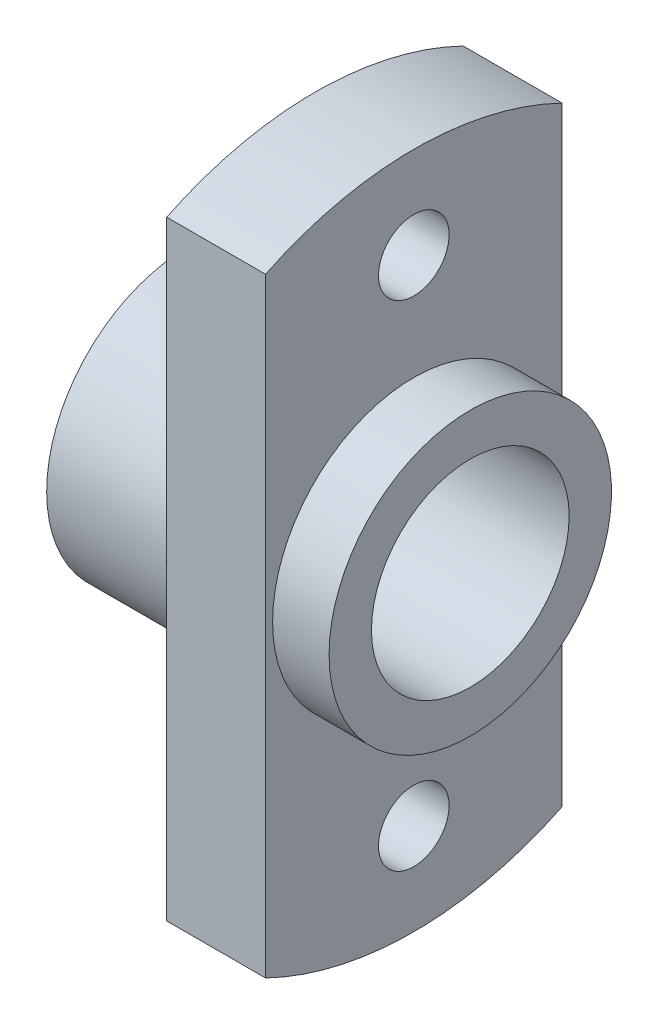
ISO-10303-21;
HEADER;
FILE_DESCRIPTION(('STEP AP214'),'2;1');
FILE_NAME('part.step','',(''),(''),'','','');
FILE_SCHEMA(('AUTOMOTIVE_DESIGN { 1 0 10303 214 1 1 1 1 }'));
ENDSEC;
DATA;
#1=APPLICATION_CONTEXT('core data for automotive mechanical design processes');
#2=APPLICATION_PROTOCOL_DEFINITION('international standard','automotive_design',2000,#1);
#3=PRODUCT_CONTEXT('',#1,'mechanical');
#4=PRODUCT('Part','Part','',(#3));
#5=PRODUCT_RELATED_PRODUCT_CATEGORY('part','',(#4));
#6=PRODUCT_DEFINITION_FORMATION('','',#4);
#7=PRODUCT_DEFINITION_CONTEXT('part definition',#1,'design');
#8=PRODUCT_DEFINITION('design','',#6,#7);
#9=PRODUCT_DEFINITION_SHAPE('','',#8);
#10=(LENGTH_UNIT() NAMED_UNIT(*) SI_UNIT(.MILLI.,.METRE.));
#11=(NAMED_UNIT(*) PLANE_ANGLE_UNIT() SI_UNIT($,.RADIAN.));
#12=(NAMED_UNIT(*) SI_UNIT($,.STERADIAN.) SOLID_ANGLE_UNIT());
#13=UNCERTAINTY_MEASURE_WITH_UNIT(LENGTH_MEASURE(1.E-05),#10,'distance_accuracy_value','');
#14=(GEOMETRIC_REPRESENTATION_CONTEXT(3) GLOBAL_UNCERTAINTY_ASSIGNED_CONTEXT((#13)) GLOBAL_UNIT_ASSIGNED_CONTEXT((#10,
#11,#12)) REPRESENTATION_CONTEXT('',''));
#15=CARTESIAN_POINT('',(0.,0.,0.));
#16=DIRECTION('',(0.,0.,1.));
#17=DIRECTION('',(1.,0.,0.));
#18=AXIS2_PLACEMENT_3D('',#15,#16,#17);
#19=CARTESIAN_POINT('',(-27.2262395336304,0.,0.));
#20=DIRECTION('',(-1.,0.,0.));
#21=DIRECTION('',(0.,0.,1.));
#22=AXIS2_PLACEMENT_3D('',#19,#20,#21);
#23=CYLINDRICAL_SURFACE('',#22,12.);
#24=CARTESIAN_POINT('',(8.,0.,0.));
#25=DIRECTION('',(-1.,0.,0.));
#26=DIRECTION('',(0.,0.,1.));
#27=AXIS2_PLACEMENT_3D('',#24,#25,#26);
#28=CIRCLE('',#27,12.);
#29=CARTESIAN_POINT('',(8.,10.7906209274536,5.25));
#30=VERTEX_POINT('',#29);
#31=CARTESIAN_POINT('',(8.,10.7906209274536,-5.25));
#32=VERTEX_POINT('',#31);
#33=EDGE_CURVE('E87',#30,#32,#28,.T.);
#34=ORIENTED_EDGE('',*,*,#33,.T.);
#35=DIRECTION('',(-1.,0.,0.));
#36=VECTOR('',#35,1.);
#37=CARTESIAN_POINT('',(-27.2262395336304,10.7906209274536,-5.25));
#38=LINE('',#37,#36);
#39=CARTESIAN_POINT('',(4.5,10.7906209274536,-5.25));
#40=VERTEX_POINT('',#39);
#41=EDGE_CURVE('E61',#32,#40,#38,.T.);
#42=ORIENTED_EDGE('',*,*,#41,.T.);
#43=CARTESIAN_POINT('',(4.5,0.,0.));
#44=DIRECTION('',(-1.,0.,0.));
#45=DIRECTION('',(0.,0.,1.));
#46=AXIS2_PLACEMENT_3D('',#43,#44,#45);
#47=CIRCLE('',#46,12.);
#48=CARTESIAN_POINT('',(4.5,10.7906209274536,5.25));
#49=VERTEX_POINT('',#48);
#50=EDGE_CURVE('E89',#49,#40,#47,.T.);
#51=ORIENTED_EDGE('',*,*,#50,.F.);
#52=DIRECTION('',(-1.,0.,0.));
#53=VECTOR('',#52,1.);
#54=CARTESIAN_POINT('',(-27.2262395336304,10.7906209274536,5.25));
#55=LINE('',#54,#53);
#56=EDGE_CURVE('E77',#49,#30,#55,.F.);
#57=ORIENTED_EDGE('',*,*,#56,.T.);
#58=EDGE_LOOP('',(#34,#42,#51,#57));
#59=FACE_BOUND('',#58,.T.);
#60=ADVANCED_FACE('F38',(#59),#23,.T.);
#61=CARTESIAN_POINT('',(0.,0.,0.));
#62=DIRECTION('',(1.,0.,0.));
#63=DIRECTION('',(0.,0.,-1.));
#64=AXIS2_PLACEMENT_3D('',#61,#62,#63);
#65=PLANE('',#64);
#66=CARTESIAN_POINT('',(0.,0.,0.));
#67=DIRECTION('',(1.,0.,0.));
#68=DIRECTION('',(0.,0.,-1.));
#69=AXIS2_PLACEMENT_3D('',#66,#67,#68);
#70=CIRCLE('',#69,3.5);
#71=CARTESIAN_POINT('',(0.,0.,-3.5));
#72=VERTEX_POINT('',#71);
#73=EDGE_CURVE('E143',#72,#72,#70,.T.);
#74=ORIENTED_EDGE('',*,*,#73,.T.);
#75=EDGE_LOOP('',(#74));
#76=FACE_BOUND('',#75,.T.);
#77=CARTESIAN_POINT('',(0.,0.,0.));
#78=DIRECTION('',(-1.,0.,0.));
#79=DIRECTION('',(0.,0.,1.));
#80=AXIS2_PLACEMENT_3D('',#77,#78,#79);
#81=CIRCLE('',#80,5.);
#82=CARTESIAN_POINT('',(0.,0.,5.));
#83=VERTEX_POINT('',#82);
#84=EDGE_CURVE('E83',#83,#83,#81,.T.);
#85=ORIENTED_EDGE('',*,*,#84,.T.);
#86=EDGE_LOOP('',(#85));
#87=FACE_BOUND('',#86,.T.);
#88=ADVANCED_FACE('F40',(#76,#87),#65,.F.);
#89=CARTESIAN_POINT('',(-27.2262395336304,0.,0.));
#90=DIRECTION('',(-1.,0.,0.));
#91=DIRECTION('',(0.,0.,1.));
#92=AXIS2_PLACEMENT_3D('',#89,#90,#91);
#93=CYLINDRICAL_SURFACE('',#92,5.);
#94=ORIENTED_EDGE('',*,*,#84,.F.);
#95=EDGE_LOOP('',(#94));
#96=FACE_BOUND('',#95,.T.);
#97=CARTESIAN_POINT('',(4.5,0.,0.));
#98=DIRECTION('',(-1.,0.,0.));
#99=DIRECTION('',(0.,0.,1.));
#100=AXIS2_PLACEMENT_3D('',#97,#98,#99);
#101=CIRCLE('',#100,5.);
#102=CARTESIAN_POINT('',(4.5,0.,5.));
#103=VERTEX_POINT('',#102);
#104=EDGE_CURVE('E104',#103,#103,#101,.T.);
#105=ORIENTED_EDGE('',*,*,#104,.T.);
#106=EDGE_LOOP('',(#105));
#107=FACE_BOUND('',#106,.T.);
#108=ADVANCED_FACE('F111',(#96,#107),#93,.T.);
#109=CARTESIAN_POINT('',(4.5,5.,0.));
#110=DIRECTION('',(1.,0.,0.));
#111=DIRECTION('',(0.,0.,-1.));
#112=AXIS2_PLACEMENT_3D('',#109,#110,#111);
#113=PLANE('',#112);
#114=CARTESIAN_POINT('',(4.5,-8.75,0.));
#115=DIRECTION('',(1.,0.,0.));
#116=DIRECTION('',(0.,0.,-1.));
#117=AXIS2_PLACEMENT_3D('',#114,#115,#116);
#118=CIRCLE('',#117,1.25);
#119=CARTESIAN_POINT('',(4.5,-8.75,-1.25));
#120=VERTEX_POINT('',#119);
#121=EDGE_CURVE('E132',#120,#120,#118,.T.);
#122=ORIENTED_EDGE('',*,*,#121,.T.);
#123=EDGE_LOOP('',(#122));
#124=FACE_BOUND('',#123,.T.);
#125=CARTESIAN_POINT('',(4.5,8.75,0.));
#126=DIRECTION('',(1.,0.,0.));
#127=DIRECTION('',(0.,0.,-1.));
#128=AXIS2_PLACEMENT_3D('',#125,#126,#127);
#129=CIRCLE('',#128,1.25);
#130=CARTESIAN_POINT('',(4.5,8.75,-1.25));
#131=VERTEX_POINT('',#130);
#132=EDGE_CURVE('E126',#131,#131,#129,.T.);
#133=ORIENTED_EDGE('',*,*,#132,.T.);
#134=EDGE_LOOP('',(#133));
#135=FACE_BOUND('',#134,.T.);
#136=ORIENTED_EDGE('',*,*,#104,.F.);
#137=EDGE_LOOP('',(#136));
#138=FACE_BOUND('',#137,.T.);
#139=ORIENTED_EDGE('',*,*,#50,.T.);
#140=DIRECTION('',(0.,-1.,0.));
#141=VECTOR('',#140,1.);
#142=CARTESIAN_POINT('',(4.5,5.,-5.25));
#143=LINE('',#142,#141);
#144=CARTESIAN_POINT('',(4.5,-10.7906209274536,-5.25));
#145=VERTEX_POINT('',#144);
#146=EDGE_CURVE('E123',#40,#145,#143,.T.);
#147=ORIENTED_EDGE('',*,*,#146,.T.);
#148=CARTESIAN_POINT('',(4.5,-10.7906209274536,5.25));
#149=VERTEX_POINT('',#148);
#150=EDGE_CURVE('E95',#145,#149,#47,.T.);
#151=ORIENTED_EDGE('',*,*,#150,.T.);
#152=DIRECTION('',(0.,1.,0.));
#153=VECTOR('',#152,1.);
#154=CARTESIAN_POINT('',(4.5,5.,5.25));
#155=LINE('',#154,#153);
#156=EDGE_CURVE('E90',#149,#49,#155,.T.);
#157=ORIENTED_EDGE('',*,*,#156,.T.);
#158=EDGE_LOOP('',(#139,#147,#151,#157));
#159=FACE_BOUND('',#158,.T.);
#160=ADVANCED_FACE('F114',(#124,#135,#138,#159),#113,.F.);
#161=ORIENTED_EDGE('',*,*,#150,.F.);
#162=DIRECTION('',(-1.,0.,0.));
#163=VECTOR('',#162,1.);
#164=CARTESIAN_POINT('',(-27.2262395336304,-10.7906209274536,-5.25));
#165=LINE('',#164,#163);
#166=CARTESIAN_POINT('',(8.,-10.7906209274536,-5.25));
#167=VERTEX_POINT('',#166);
#168=EDGE_CURVE('E135',#145,#167,#165,.F.);
#169=ORIENTED_EDGE('',*,*,#168,.T.);
#170=CARTESIAN_POINT('',(8.,-10.7906209274536,5.25));
#171=VERTEX_POINT('',#170);
#172=EDGE_CURVE('E96',#167,#171,#28,.T.);
#173=ORIENTED_EDGE('',*,*,#172,.T.);
#174=DIRECTION('',(-1.,0.,0.));
#175=VECTOR('',#174,1.);
#176=CARTESIAN_POINT('',(-27.2262395336304,-10.7906209274536,5.25));
#177=LINE('',#176,#175);
#178=EDGE_CURVE('E53',#171,#149,#177,.T.);
#179=ORIENTED_EDGE('',*,*,#178,.T.);
#180=EDGE_LOOP('',(#161,#169,#173,#179));
#181=FACE_BOUND('',#180,.T.);
#182=ADVANCED_FACE('F119',(#181),#23,.T.);
#183=CARTESIAN_POINT('',(8.,12.,0.));
#184=DIRECTION('',(-1.,0.,0.));
#185=DIRECTION('',(0.,0.,1.));
#186=AXIS2_PLACEMENT_3D('',#183,#184,#185);
#187=PLANE('',#186);
#188=CARTESIAN_POINT('',(8.,-8.75,0.));
#189=DIRECTION('',(1.,0.,0.));
#190=DIRECTION('',(0.,0.,-1.));
#191=AXIS2_PLACEMENT_3D('',#188,#189,#190);
#192=CIRCLE('',#191,1.25);
#193=CARTESIAN_POINT('',(8.,-8.75,-1.25));
#194=VERTEX_POINT('',#193);
#195=EDGE_CURVE('E281',#194,#194,#192,.T.);
#196=ORIENTED_EDGE('',*,*,#195,.F.);
#197=EDGE_LOOP('',(#196));
#198=FACE_BOUND('',#197,.T.);
#199=CARTESIAN_POINT('',(8.,8.75,0.));
#200=DIRECTION('',(1.,0.,0.));
#201=DIRECTION('',(0.,0.,-1.));
#202=AXIS2_PLACEMENT_3D('',#199,#200,#201);
#203=CIRCLE('',#202,1.25);
#204=CARTESIAN_POINT('',(8.,8.75,-1.25));
#205=VERTEX_POINT('',#204);
#206=EDGE_CURVE('E91',#205,#205,#203,.T.);
#207=ORIENTED_EDGE('',*,*,#206,.F.);
#208=EDGE_LOOP('',(#207));
#209=FACE_BOUND('',#208,.T.);
#210=ORIENTED_EDGE('',*,*,#172,.F.);
#211=DIRECTION('',(0.,1.,0.));
#212=VECTOR('',#211,1.);
#213=CARTESIAN_POINT('',(8.,12.,-5.25));
#214=LINE('',#213,#212);
#215=EDGE_CURVE('E11',#167,#32,#214,.T.);
#216=ORIENTED_EDGE('',*,*,#215,.T.);
#217=ORIENTED_EDGE('',*,*,#33,.F.);
#218=DIRECTION('',(0.,-1.,0.));
#219=VECTOR('',#218,1.);
#220=CARTESIAN_POINT('',(8.,12.,5.25));
#221=LINE('',#220,#219);
#222=EDGE_CURVE('E46',#30,#171,#221,.T.);
#223=ORIENTED_EDGE('',*,*,#222,.T.);
#224=EDGE_LOOP('',(#210,#216,#217,#223));
#225=FACE_BOUND('',#224,.T.);
#226=CARTESIAN_POINT('',(8.,0.,0.));
#227=DIRECTION('',(-1.,0.,0.));
#228=DIRECTION('',(0.,0.,1.));
#229=AXIS2_PLACEMENT_3D('',#226,#227,#228);
#230=CIRCLE('',#229,5.);
#231=CARTESIAN_POINT('',(8.,0.,5.));
#232=VERTEX_POINT('',#231);
#233=EDGE_CURVE('E100',#232,#232,#230,.T.);
#234=ORIENTED_EDGE('',*,*,#233,.T.);
#235=EDGE_LOOP('',(#234));
#236=FACE_BOUND('',#235,.T.);
#237=ADVANCED_FACE('F93',(#198,#209,#225,#236),#187,.F.);
#238=CARTESIAN_POINT('',(-27.2262395336304,0.,0.));
#239=DIRECTION('',(-1.,0.,0.));
#240=DIRECTION('',(0.,0.,1.));
#241=AXIS2_PLACEMENT_3D('',#238,#239,#240);
#242=CYLINDRICAL_SURFACE('',#241,5.);
#243=ORIENTED_EDGE('',*,*,#233,.F.);
#244=EDGE_LOOP('',(#243));
#245=FACE_BOUND('',#244,.T.);
#246=CARTESIAN_POINT('',(10.,0.,0.));
#247=DIRECTION('',(-1.,0.,0.));
#248=DIRECTION('',(0.,0.,1.));
#249=AXIS2_PLACEMENT_3D('',#246,#247,#248);
#250=CIRCLE('',#249,5.);
#251=CARTESIAN_POINT('',(10.,0.,5.));
#252=VERTEX_POINT('',#251);
#253=EDGE_CURVE('E145',#252,#252,#250,.T.);
#254=ORIENTED_EDGE('',*,*,#253,.T.);
#255=EDGE_LOOP('',(#254));
#256=FACE_BOUND('',#255,.T.);
#257=ADVANCED_FACE('F152',(#245,#256),#242,.T.);
#258=CARTESIAN_POINT('',(10.,5.,0.));
#259=DIRECTION('',(-1.,0.,0.));
#260=DIRECTION('',(0.,0.,1.));
#261=AXIS2_PLACEMENT_3D('',#258,#259,#260);
#262=PLANE('',#261);
#263=CARTESIAN_POINT('',(10.,0.,0.));
#264=DIRECTION('',(1.,0.,0.));
#265=DIRECTION('',(0.,0.,-1.));
#266=AXIS2_PLACEMENT_3D('',#263,#264,#265);
#267=CIRCLE('',#266,3.5);
#268=CARTESIAN_POINT('',(10.,0.,-3.5));
#269=VERTEX_POINT('',#268);
#270=EDGE_CURVE('E140',#269,#269,#267,.T.);
#271=ORIENTED_EDGE('',*,*,#270,.F.);
#272=EDGE_LOOP('',(#271));
#273=FACE_BOUND('',#272,.T.);
#274=ORIENTED_EDGE('',*,*,#253,.F.);
#275=EDGE_LOOP('',(#274));
#276=FACE_BOUND('',#275,.T.);
#277=ADVANCED_FACE('F154',(#273,#276),#262,.F.);
#278=CARTESIAN_POINT('',(10.,0.,0.));
#279=DIRECTION('',(1.,0.,0.));
#280=DIRECTION('',(0.,0.,-1.));
#281=AXIS2_PLACEMENT_3D('',#278,#279,#280);
#282=CYLINDRICAL_SURFACE('',#281,3.5);
#283=ORIENTED_EDGE('',*,*,#73,.F.);
#284=EDGE_LOOP('',(#283));
#285=FACE_BOUND('',#284,.T.);
#286=ORIENTED_EDGE('',*,*,#270,.T.);
#287=EDGE_LOOP('',(#286));
#288=FACE_BOUND('',#287,.T.);
#289=ADVANCED_FACE('F160',(#285,#288),#282,.F.);
#290=CARTESIAN_POINT('',(0.,14.9424549187947,5.25));
#291=DIRECTION('',(0.,0.,-1.));
#292=DIRECTION('',(-1.,0.,0.));
#293=AXIS2_PLACEMENT_3D('',#290,#291,#292);
#294=PLANE('',#293);
#295=ORIENTED_EDGE('',*,*,#222,.F.);
#296=ORIENTED_EDGE('',*,*,#56,.F.);
#297=ORIENTED_EDGE('',*,*,#156,.F.);
#298=ORIENTED_EDGE('',*,*,#178,.F.);
#299=EDGE_LOOP('',(#295,#296,#297,#298));
#300=FACE_BOUND('',#299,.T.);
#301=ADVANCED_FACE('F76',(#300),#294,.F.);
#302=CARTESIAN_POINT('',(0.,8.75,0.));
#303=DIRECTION('',(1.,0.,0.));
#304=DIRECTION('',(0.,0.,-1.));
#305=AXIS2_PLACEMENT_3D('',#302,#303,#304);
#306=CYLINDRICAL_SURFACE('',#305,1.25);
#307=ORIENTED_EDGE('',*,*,#206,.T.);
#308=EDGE_LOOP('',(#307));
#309=FACE_BOUND('',#308,.T.);
#310=ORIENTED_EDGE('',*,*,#132,.F.);
#311=EDGE_LOOP('',(#310));
#312=FACE_BOUND('',#311,.T.);
#313=ADVANCED_FACE('F182',(#309,#312),#306,.F.);
#314=CARTESIAN_POINT('',(0.,-8.75,0.));
#315=DIRECTION('',(1.,0.,0.));
#316=DIRECTION('',(0.,0.,-1.));
#317=AXIS2_PLACEMENT_3D('',#314,#315,#316);
#318=CYLINDRICAL_SURFACE('',#317,1.25);
#319=ORIENTED_EDGE('',*,*,#195,.T.);
#320=EDGE_LOOP('',(#319));
#321=FACE_BOUND('',#320,.T.);
#322=ORIENTED_EDGE('',*,*,#121,.F.);
#323=EDGE_LOOP('',(#322));
#324=FACE_BOUND('',#323,.T.);
#325=ADVANCED_FACE('F177',(#321,#324),#318,.F.);
#326=CARTESIAN_POINT('',(0.,14.9424549187947,-5.25));
#327=DIRECTION('',(0.,0.,1.));
#328=DIRECTION('',(1.,0.,0.));
#329=AXIS2_PLACEMENT_3D('',#326,#327,#328);
#330=PLANE('',#329);
#331=ORIENTED_EDGE('',*,*,#215,.F.);
#332=ORIENTED_EDGE('',*,*,#168,.F.);
#333=ORIENTED_EDGE('',*,*,#146,.F.);
#334=ORIENTED_EDGE('',*,*,#41,.F.);
#335=EDGE_LOOP('',(#331,#332,#333,#334));
#336=FACE_BOUND('',#335,.T.);
#337=ADVANCED_FACE('F175',(#336),#330,.F.);
#338=CLOSED_SHELL('',(#60,#88,#108,#160,#182,#237,#257,#277,#289,#301,#313,#325,#337));
#339=MANIFOLD_SOLID_BREP('B2',#338);
#340=ADVANCED_BREP_SHAPE_REPRESENTATION('',(#18,#339),#14);
#341=SHAPE_DEFINITION_REPRESENTATION(#9,#340);
ENDSEC;
END-ISO-10303-21;
